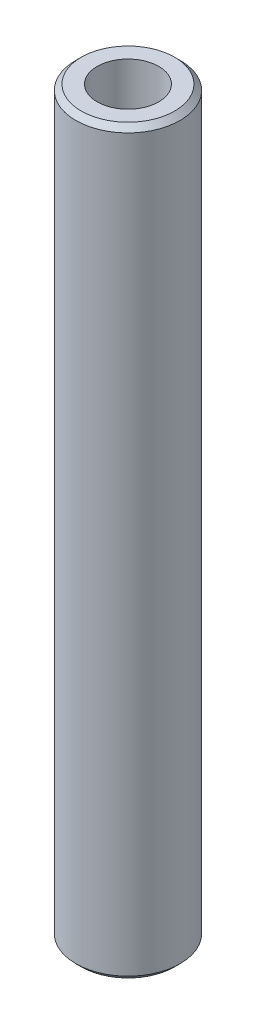
ISO-10303-21;
HEADER;
FILE_DESCRIPTION(('STEP AP214'),'2;1');
FILE_NAME('part.step','',(''),(''),'','','');
FILE_SCHEMA(('AUTOMOTIVE_DESIGN { 1 0 10303 214 1 1 1 1 }'));
ENDSEC;
DATA;
#1=APPLICATION_CONTEXT('core data for automotive mechanical design processes');
#2=APPLICATION_PROTOCOL_DEFINITION('international standard','automotive_design',2000,#1);
#3=PRODUCT_CONTEXT('',#1,'mechanical');
#4=PRODUCT('Part','Part','',(#3));
#5=PRODUCT_RELATED_PRODUCT_CATEGORY('part','',(#4));
#6=PRODUCT_DEFINITION_FORMATION('','',#4);
#7=PRODUCT_DEFINITION_CONTEXT('part definition',#1,'design');
#8=PRODUCT_DEFINITION('design','',#6,#7);
#9=PRODUCT_DEFINITION_SHAPE('','',#8);
#10=(LENGTH_UNIT() NAMED_UNIT(*) SI_UNIT(.MILLI.,.METRE.));
#11=(NAMED_UNIT(*) PLANE_ANGLE_UNIT() SI_UNIT($,.RADIAN.));
#12=(NAMED_UNIT(*) SI_UNIT($,.STERADIAN.) SOLID_ANGLE_UNIT());
#13=UNCERTAINTY_MEASURE_WITH_UNIT(LENGTH_MEASURE(1.E-05),#10,'distance_accuracy_value','');
#14=(GEOMETRIC_REPRESENTATION_CONTEXT(3) GLOBAL_UNCERTAINTY_ASSIGNED_CONTEXT((#13)) GLOBAL_UNIT_ASSIGNED_CONTEXT((#10,
#11,#12)) REPRESENTATION_CONTEXT('',''));
#15=CARTESIAN_POINT('',(0.,0.,0.));
#16=DIRECTION('',(0.,0.,1.));
#17=DIRECTION('',(1.,0.,0.));
#18=AXIS2_PLACEMENT_3D('',#15,#16,#17);
#19=CARTESIAN_POINT('',(0.,248.843222343713,0.));
#20=DIRECTION('',(0.,-1.,0.));
#21=DIRECTION('',(0.,0.,-1.));
#22=AXIS2_PLACEMENT_3D('',#19,#20,#21);
#23=CYLINDRICAL_SURFACE('',#22,17.5);
#24=CARTESIAN_POINT('',(0.,247.021260844648,0.));
#25=DIRECTION('',(0.,1.,0.));
#26=DIRECTION('',(0.,0.,1.));
#27=AXIS2_PLACEMENT_3D('',#24,#25,#26);
#28=CIRCLE('',#27,17.5);
#29=CARTESIAN_POINT('',(0.,247.021260844648,17.5));
#30=VERTEX_POINT('',#29);
#31=EDGE_CURVE('E50',#30,#30,#28,.F.);
#32=ORIENTED_EDGE('',*,*,#31,.T.);
#33=EDGE_LOOP('',(#32));
#34=FACE_BOUND('',#33,.T.);
#35=CARTESIAN_POINT('',(0.,1.82196149906483,0.));
#36=DIRECTION('',(0.,1.,0.));
#37=DIRECTION('',(0.,0.,1.));
#38=AXIS2_PLACEMENT_3D('',#35,#36,#37);
#39=CIRCLE('',#38,17.5);
#40=CARTESIAN_POINT('',(0.,1.82196149906483,17.5));
#41=VERTEX_POINT('',#40);
#42=EDGE_CURVE('E51',#41,#41,#39,.T.);
#43=ORIENTED_EDGE('',*,*,#42,.T.);
#44=EDGE_LOOP('',(#43));
#45=FACE_BOUND('',#44,.T.);
#46=ADVANCED_FACE('F39',(#34,#45),#23,.T.);
#47=CARTESIAN_POINT('',(0.,248.843222343713,0.));
#48=DIRECTION('',(0.,1.,0.));
#49=DIRECTION('',(0.,0.,1.));
#50=AXIS2_PLACEMENT_3D('',#47,#48,#49);
#51=PLANE('',#50);
#52=CARTESIAN_POINT('',(0.,248.843222343713,0.));
#53=DIRECTION('',(0.,1.,0.));
#54=DIRECTION('',(0.,0.,1.));
#55=AXIS2_PLACEMENT_3D('',#52,#53,#54);
#56=CIRCLE('',#55,15.6780385009352);
#57=CARTESIAN_POINT('',(0.,248.843222343713,15.6780385009352));
#58=VERTEX_POINT('',#57);
#59=EDGE_CURVE('E54',#58,#58,#56,.T.);
#60=ORIENTED_EDGE('',*,*,#59,.T.);
#61=EDGE_LOOP('',(#60));
#62=FACE_BOUND('',#61,.T.);
#63=CARTESIAN_POINT('',(0.,248.843222343713,0.));
#64=DIRECTION('',(0.,1.,0.));
#65=DIRECTION('',(0.,0.,1.));
#66=AXIS2_PLACEMENT_3D('',#63,#64,#65);
#67=CIRCLE('',#66,10.331876846866);
#68=CARTESIAN_POINT('',(0.,248.843222343713,10.331876846866));
#69=VERTEX_POINT('',#68);
#70=EDGE_CURVE('E58',#69,#69,#67,.T.);
#71=ORIENTED_EDGE('',*,*,#70,.F.);
#72=EDGE_LOOP('',(#71));
#73=FACE_BOUND('',#72,.T.);
#74=ADVANCED_FACE('F69',(#62,#73),#51,.T.);
#75=CARTESIAN_POINT('',(0.,0.,0.));
#76=DIRECTION('',(0.,1.,0.));
#77=DIRECTION('',(0.,0.,1.));
#78=AXIS2_PLACEMENT_3D('',#75,#76,#77);
#79=PLANE('',#78);
#80=CARTESIAN_POINT('',(0.,0.,0.));
#81=DIRECTION('',(0.,1.,0.));
#82=DIRECTION('',(0.,0.,1.));
#83=AXIS2_PLACEMENT_3D('',#80,#81,#82);
#84=CIRCLE('',#83,15.6780385009351);
#85=CARTESIAN_POINT('',(0.,0.,15.6780385009351));
#86=VERTEX_POINT('',#85);
#87=EDGE_CURVE('E10',#86,#86,#84,.F.);
#88=ORIENTED_EDGE('',*,*,#87,.T.);
#89=EDGE_LOOP('',(#88));
#90=FACE_BOUND('',#89,.T.);
#91=CARTESIAN_POINT('',(0.,0.,0.));
#92=DIRECTION('',(0.,1.,0.));
#93=DIRECTION('',(0.,0.,1.));
#94=AXIS2_PLACEMENT_3D('',#91,#92,#93);
#95=CIRCLE('',#94,10.331876846866);
#96=CARTESIAN_POINT('',(0.,0.,10.331876846866));
#97=VERTEX_POINT('',#96);
#98=EDGE_CURVE('E63',#97,#97,#95,.T.);
#99=ORIENTED_EDGE('',*,*,#98,.T.);
#100=EDGE_LOOP('',(#99));
#101=FACE_BOUND('',#100,.T.);
#102=ADVANCED_FACE('F75',(#90,#101),#79,.F.);
#103=CARTESIAN_POINT('',(0.,248.843222343713,0.));
#104=DIRECTION('',(0.,-1.,0.));
#105=DIRECTION('',(0.,0.,-1.));
#106=AXIS2_PLACEMENT_3D('',#103,#104,#105);
#107=CYLINDRICAL_SURFACE('',#106,10.331876846866);
#108=ORIENTED_EDGE('',*,*,#70,.T.);
#109=EDGE_LOOP('',(#108));
#110=FACE_BOUND('',#109,.T.);
#111=ORIENTED_EDGE('',*,*,#98,.F.);
#112=EDGE_LOOP('',(#111));
#113=FACE_BOUND('',#112,.T.);
#114=ADVANCED_FACE('F70',(#110,#113),#107,.F.);
#115=CARTESIAN_POINT('',(0.,248.843222343713,0.));
#116=DIRECTION('',(0.,-1.,0.));
#117=DIRECTION('',(0.,0.,-1.));
#118=AXIS2_PLACEMENT_3D('',#115,#116,#117);
#119=CONICAL_SURFACE('',#118,15.6780385009352,0.785398163397453);
#120=ORIENTED_EDGE('',*,*,#31,.F.);
#121=EDGE_LOOP('',(#120));
#122=FACE_BOUND('',#121,.T.);
#123=ORIENTED_EDGE('',*,*,#59,.F.);
#124=EDGE_LOOP('',(#123));
#125=FACE_BOUND('',#124,.T.);
#126=ADVANCED_FACE('F81',(#122,#125),#119,.T.);
#127=CARTESIAN_POINT('',(0.,1.82196149906483,0.));
#128=DIRECTION('',(0.,1.,0.));
#129=DIRECTION('',(0.,0.,1.));
#130=AXIS2_PLACEMENT_3D('',#127,#128,#129);
#131=CONICAL_SURFACE('',#130,17.5,0.785398163397461);
#132=ORIENTED_EDGE('',*,*,#87,.F.);
#133=EDGE_LOOP('',(#132));
#134=FACE_BOUND('',#133,.T.);
#135=ORIENTED_EDGE('',*,*,#42,.F.);
#136=EDGE_LOOP('',(#135));
#137=FACE_BOUND('',#136,.T.);
#138=ADVANCED_FACE('F45',(#134,#137),#131,.T.);
#139=CLOSED_SHELL('',(#46,#74,#102,#114,#126,#138));
#140=MANIFOLD_SOLID_BREP('B2',#139);
#141=ADVANCED_BREP_SHAPE_REPRESENTATION('',(#18,#140),#14);
#142=SHAPE_DEFINITION_REPRESENTATION(#9,#141);
ENDSEC;
END-ISO-10303-21;
